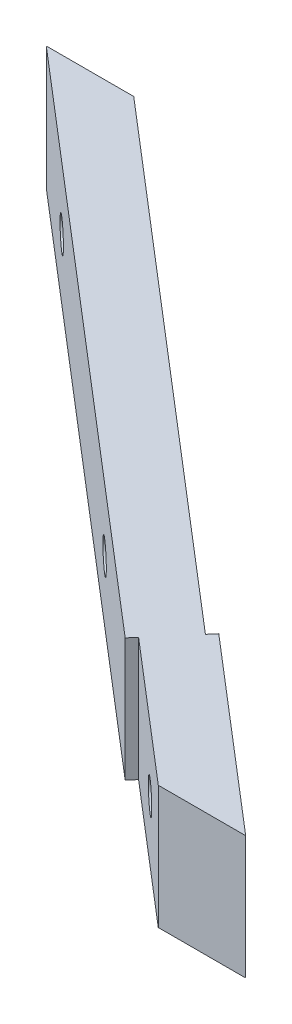
ISO-10303-21;
HEADER;
FILE_DESCRIPTION(('STEP AP214'),'2;1');
FILE_NAME('part.step','',(''),(''),'','','');
FILE_SCHEMA(('AUTOMOTIVE_DESIGN { 1 0 10303 214 1 1 1 1 }'));
ENDSEC;
DATA;
#1=APPLICATION_CONTEXT('core data for automotive mechanical design processes');
#2=APPLICATION_PROTOCOL_DEFINITION('international standard','automotive_design',2000,#1);
#3=PRODUCT_CONTEXT('',#1,'mechanical');
#4=PRODUCT('Part','Part','',(#3));
#5=PRODUCT_RELATED_PRODUCT_CATEGORY('part','',(#4));
#6=PRODUCT_DEFINITION_FORMATION('','',#4);
#7=PRODUCT_DEFINITION_CONTEXT('part definition',#1,'design');
#8=PRODUCT_DEFINITION('design','',#6,#7);
#9=PRODUCT_DEFINITION_SHAPE('','',#8);
#10=(LENGTH_UNIT() NAMED_UNIT(*) SI_UNIT(.MILLI.,.METRE.));
#11=(NAMED_UNIT(*) PLANE_ANGLE_UNIT() SI_UNIT($,.RADIAN.));
#12=(NAMED_UNIT(*) SI_UNIT($,.STERADIAN.) SOLID_ANGLE_UNIT());
#13=UNCERTAINTY_MEASURE_WITH_UNIT(LENGTH_MEASURE(1.E-05),#10,'distance_accuracy_value','');
#14=(GEOMETRIC_REPRESENTATION_CONTEXT(3) GLOBAL_UNCERTAINTY_ASSIGNED_CONTEXT((#13)) GLOBAL_UNIT_ASSIGNED_CONTEXT((#10,
#11,#12)) REPRESENTATION_CONTEXT('',''));
#15=CARTESIAN_POINT('',(0.,0.,0.));
#16=DIRECTION('',(0.,0.,1.));
#17=DIRECTION('',(1.,0.,0.));
#18=AXIS2_PLACEMENT_3D('',#15,#16,#17);
#19=CARTESIAN_POINT('',(62.1354603296371,0.249999999999999,-17.0285302397047));
#20=DIRECTION('',(0.650774217265846,0.,-0.759271307334885));
#21=DIRECTION('',(-0.759271307334885,0.,-0.650774217265846));
#22=AXIS2_PLACEMENT_3D('',#19,#20,#21);
#23=PLANE('',#22);
#24=CARTESIAN_POINT('',(70.613674794916,-6.375,-9.76182158213607));
#25=DIRECTION('',(0.650774217265846,0.,-0.759271307334885));
#26=DIRECTION('',(-0.759271307334885,0.,-0.650774217265846));
#27=AXIS2_PLACEMENT_3D('',#24,#25,#26);
#28=CIRCLE('',#27,1.62500000000002);
#29=CARTESIAN_POINT('',(69.3798589204968,-6.375,-10.8193296851931));
#30=VERTEX_POINT('',#29);
#31=EDGE_CURVE('E191',#30,#30,#28,.F.);
#32=ORIENTED_EDGE('',*,*,#31,.T.);
#33=EDGE_LOOP('',(#32));
#34=FACE_BOUND('',#33,.T.);
#35=DIRECTION('',(0.759271307334885,0.,0.650774217265846));
#36=VECTOR('',#35,1.);
#37=CARTESIAN_POINT('',(62.1354603296371,-12.75,-17.0285302397047));
#38=LINE('',#37,#36);
#39=CARTESIAN_POINT('',(62.1354603296371,-12.75,-17.0285302397047));
#40=VERTEX_POINT('',#39);
#41=CARTESIAN_POINT('',(82.002987459727,-12.75,0.));
#42=VERTEX_POINT('',#41);
#43=EDGE_CURVE('E170',#40,#42,#38,.T.);
#44=ORIENTED_EDGE('',*,*,#43,.F.);
#45=DIRECTION('',(0.,-1.,0.));
#46=VECTOR('',#45,1.);
#47=CARTESIAN_POINT('',(62.1354603296371,0.249999999999999,-17.0285302397047));
#48=LINE('',#47,#46);
#49=CARTESIAN_POINT('',(62.1354603296371,0.249999999999999,-17.0285302397047));
#50=VERTEX_POINT('',#49);
#51=EDGE_CURVE('E11',#50,#40,#48,.T.);
#52=ORIENTED_EDGE('',*,*,#51,.F.);
#53=DIRECTION('',(0.759271307334885,0.,0.650774217265846));
#54=VECTOR('',#53,1.);
#55=CARTESIAN_POINT('',(82.002987459727,0.249999999999999,0.));
#56=LINE('',#55,#54);
#57=CARTESIAN_POINT('',(82.002987459727,0.249999999999999,0.));
#58=VERTEX_POINT('',#57);
#59=EDGE_CURVE('E59',#50,#58,#56,.T.);
#60=ORIENTED_EDGE('',*,*,#59,.T.);
#61=DIRECTION('',(0.,-1.,0.));
#62=VECTOR('',#61,1.);
#63=CARTESIAN_POINT('',(82.002987459727,0.249999999999999,0.));
#64=LINE('',#63,#62);
#65=EDGE_CURVE('E100',#58,#42,#64,.T.);
#66=ORIENTED_EDGE('',*,*,#65,.T.);
#67=EDGE_LOOP('',(#44,#52,#60,#66));
#68=FACE_BOUND('',#67,.T.);
#69=ADVANCED_FACE('F39',(#34,#68),#23,.T.);
#70=CARTESIAN_POINT('',(61.4846861123713,0.249999999999999,-16.2692589323698));
#71=DIRECTION('',(-0.759271307334888,0.,-0.650774217265843));
#72=DIRECTION('',(-0.650774217265843,0.,0.759271307334888));
#73=AXIS2_PLACEMENT_3D('',#70,#71,#72);
#74=PLANE('',#73);
#75=DIRECTION('',(0.650774217265843,0.,-0.759271307334888));
#76=VECTOR('',#75,1.);
#77=CARTESIAN_POINT('',(61.4846861123713,-12.75,-16.2692589323698));
#78=LINE('',#77,#76);
#79=CARTESIAN_POINT('',(61.4846861123713,-12.75,-16.2692589323698));
#80=VERTEX_POINT('',#79);
#81=EDGE_CURVE('E167',#80,#40,#78,.T.);
#82=ORIENTED_EDGE('',*,*,#81,.F.);
#83=DIRECTION('',(0.,-1.,0.));
#84=VECTOR('',#83,1.);
#85=CARTESIAN_POINT('',(61.4846861123713,0.249999999999999,-16.2692589323698));
#86=LINE('',#85,#84);
#87=CARTESIAN_POINT('',(61.4846861123713,0.249999999999999,-16.2692589323698));
#88=VERTEX_POINT('',#87);
#89=EDGE_CURVE('E50',#88,#80,#86,.T.);
#90=ORIENTED_EDGE('',*,*,#89,.F.);
#91=DIRECTION('',(0.650774217265843,0.,-0.759271307334888));
#92=VECTOR('',#91,1.);
#93=CARTESIAN_POINT('',(61.4846861123713,0.249999999999999,-16.2692589323698));
#94=LINE('',#93,#92);
#95=EDGE_CURVE('E131',#88,#50,#94,.T.);
#96=ORIENTED_EDGE('',*,*,#95,.T.);
#97=ORIENTED_EDGE('',*,*,#51,.T.);
#98=EDGE_LOOP('',(#82,#90,#96,#97));
#99=FACE_BOUND('',#98,.T.);
#100=ADVANCED_FACE('F231',(#99),#74,.T.);
#101=CARTESIAN_POINT('',(8.56917557383048,0.249999999999999,-61.6233367426));
#102=DIRECTION('',(0.650774217265846,0.,-0.759271307334884));
#103=DIRECTION('',(-0.759271307334885,0.,-0.650774217265847));
#104=AXIS2_PLACEMENT_3D('',#101,#102,#103);
#105=PLANE('',#104);
#106=CARTESIAN_POINT('',(46.2992599656736,-6.375,-29.2847432776867));
#107=DIRECTION('',(0.650774217265846,0.,-0.759271307334884));
#108=DIRECTION('',(-0.759271307334885,0.,-0.650774217265847));
#109=AXIS2_PLACEMENT_3D('',#106,#107,#108);
#110=CIRCLE('',#109,1.62500000000001);
#111=CARTESIAN_POINT('',(45.0654440912544,-6.375,-30.3422513807437));
#112=VERTEX_POINT('',#111);
#113=EDGE_CURVE('E150',#112,#112,#110,.F.);
#114=ORIENTED_EDGE('',*,*,#113,.T.);
#115=EDGE_LOOP('',(#114));
#116=FACE_BOUND('',#115,.T.);
#117=CARTESIAN_POINT('',(14.6431029777218,-6.375,-56.4173513276216));
#118=DIRECTION('',(0.650774217265846,0.,-0.759271307334884));
#119=DIRECTION('',(-0.759271307334885,0.,-0.650774217265847));
#120=AXIS2_PLACEMENT_3D('',#117,#118,#119);
#121=CIRCLE('',#120,1.625);
#122=CARTESIAN_POINT('',(13.4092871033027,-6.375,-57.4748594306786));
#123=VERTEX_POINT('',#122);
#124=EDGE_CURVE('E195',#123,#123,#121,.F.);
#125=ORIENTED_EDGE('',*,*,#124,.T.);
#126=EDGE_LOOP('',(#125));
#127=FACE_BOUND('',#126,.T.);
#128=DIRECTION('',(0.759271307334885,0.,0.650774217265847));
#129=VECTOR('',#128,1.);
#130=CARTESIAN_POINT('',(8.56917557383048,-12.75,-61.6233367426));
#131=LINE('',#130,#129);
#132=CARTESIAN_POINT('',(8.56917557383048,-12.75,-61.6233367426));
#133=VERTEX_POINT('',#132);
#134=EDGE_CURVE('E118',#133,#80,#131,.T.);
#135=ORIENTED_EDGE('',*,*,#134,.F.);
#136=DIRECTION('',(0.,-1.,0.));
#137=VECTOR('',#136,1.);
#138=CARTESIAN_POINT('',(8.56917557383048,0.249999999999999,-61.6233367426));
#139=LINE('',#138,#137);
#140=CARTESIAN_POINT('',(8.56917557383048,0.249999999999999,-61.6233367426));
#141=VERTEX_POINT('',#140);
#142=EDGE_CURVE('E113',#141,#133,#139,.T.);
#143=ORIENTED_EDGE('',*,*,#142,.F.);
#144=DIRECTION('',(0.759271307334885,0.,0.650774217265847));
#145=VECTOR('',#144,1.);
#146=CARTESIAN_POINT('',(8.56917557383048,0.249999999999999,-61.6233367426));
#147=LINE('',#146,#145);
#148=EDGE_CURVE('E116',#141,#88,#147,.T.);
#149=ORIENTED_EDGE('',*,*,#148,.T.);
#150=ORIENTED_EDGE('',*,*,#89,.T.);
#151=EDGE_LOOP('',(#135,#143,#149,#150));
#152=FACE_BOUND('',#151,.T.);
#153=ADVANCED_FACE('F115',(#116,#127,#152),#105,.T.);
#154=CARTESIAN_POINT('',(-0.650611935896497,0.249999999999999,-61.6233367426));
#155=DIRECTION('',(0.,0.,-1.));
#156=DIRECTION('',(-1.,0.,0.));
#157=AXIS2_PLACEMENT_3D('',#154,#155,#156);
#158=PLANE('',#157);
#159=DIRECTION('',(1.,0.,0.));
#160=VECTOR('',#159,1.);
#161=CARTESIAN_POINT('',(-0.650611935896497,-12.75,-61.6233367426));
#162=LINE('',#161,#160);
#163=CARTESIAN_POINT('',(-0.650611935896497,-12.75,-61.6233367426));
#164=VERTEX_POINT('',#163);
#165=EDGE_CURVE('E162',#164,#133,#162,.T.);
#166=ORIENTED_EDGE('',*,*,#165,.F.);
#167=DIRECTION('',(0.,-1.,0.));
#168=VECTOR('',#167,1.);
#169=CARTESIAN_POINT('',(-0.650611935896497,0.249999999999999,-61.6233367426));
#170=LINE('',#169,#168);
#171=CARTESIAN_POINT('',(-0.650611935896497,0.249999999999999,-61.6233367426));
#172=VERTEX_POINT('',#171);
#173=EDGE_CURVE('E124',#172,#164,#170,.T.);
#174=ORIENTED_EDGE('',*,*,#173,.F.);
#175=DIRECTION('',(1.,0.,0.));
#176=VECTOR('',#175,1.);
#177=CARTESIAN_POINT('',(-0.650611935896497,0.249999999999999,-61.6233367426));
#178=LINE('',#177,#176);
#179=EDGE_CURVE('E129',#172,#141,#178,.T.);
#180=ORIENTED_EDGE('',*,*,#179,.T.);
#181=ORIENTED_EDGE('',*,*,#142,.T.);
#182=EDGE_LOOP('',(#166,#174,#180,#181));
#183=FACE_BOUND('',#182,.T.);
#184=ADVANCED_FACE('F134',(#183),#158,.T.);
#185=CARTESIAN_POINT('',(-0.650611935896497,0.249999999999999,-61.6233367426));
#186=DIRECTION('',(-0.650774217265847,0.,0.759271307334884));
#187=DIRECTION('',(0.759271307334884,0.,0.650774217265847));
#188=AXIS2_PLACEMENT_3D('',#185,#186,#187);
#189=PLANE('',#188);
#190=CARTESIAN_POINT('',(42.3946146620785,-6.375,-24.7291154336774));
#191=DIRECTION('',(-0.650774217265847,0.,0.759271307334884));
#192=DIRECTION('',(0.759271307334884,0.,0.650774217265847));
#193=AXIS2_PLACEMENT_3D('',#190,#191,#192);
#194=CIRCLE('',#193,1.62500000000001);
#195=CARTESIAN_POINT('',(43.6284305364977,-6.375,-23.6716073306204));
#196=VERTEX_POINT('',#195);
#197=EDGE_CURVE('E43',#196,#196,#194,.F.);
#198=ORIENTED_EDGE('',*,*,#197,.T.);
#199=EDGE_LOOP('',(#198));
#200=FACE_BOUND('',#199,.T.);
#201=CARTESIAN_POINT('',(10.7384576741268,-6.375,-51.8617234836123));
#202=DIRECTION('',(-0.650774217265847,0.,0.759271307334884));
#203=DIRECTION('',(0.759271307334884,0.,0.650774217265847));
#204=AXIS2_PLACEMENT_3D('',#201,#202,#203);
#205=CIRCLE('',#204,1.625);
#206=CARTESIAN_POINT('',(11.9722735485459,-6.375,-50.8042153805553));
#207=VERTEX_POINT('',#206);
#208=EDGE_CURVE('E192',#207,#207,#205,.F.);
#209=ORIENTED_EDGE('',*,*,#208,.T.);
#210=EDGE_LOOP('',(#209));
#211=FACE_BOUND('',#210,.T.);
#212=DIRECTION('',(-0.759271307334884,0.,-0.650774217265847));
#213=VECTOR('',#212,1.);
#214=CARTESIAN_POINT('',(-0.650611935896497,-12.75,-61.6233367426));
#215=LINE('',#214,#213);
#216=CARTESIAN_POINT('',(57.5800408087762,-12.75,-11.7136310883605));
#217=VERTEX_POINT('',#216);
#218=EDGE_CURVE('E158',#217,#164,#215,.T.);
#219=ORIENTED_EDGE('',*,*,#218,.F.);
#220=DIRECTION('',(0.,-1.,0.));
#221=VECTOR('',#220,1.);
#222=CARTESIAN_POINT('',(57.5800408087762,0.249999999999999,-11.7136310883605));
#223=LINE('',#222,#221);
#224=CARTESIAN_POINT('',(57.5800408087762,0.249999999999999,-11.7136310883605));
#225=VERTEX_POINT('',#224);
#226=EDGE_CURVE('E177',#225,#217,#223,.T.);
#227=ORIENTED_EDGE('',*,*,#226,.F.);
#228=DIRECTION('',(-0.759271307334884,0.,-0.650774217265847));
#229=VECTOR('',#228,1.);
#230=CARTESIAN_POINT('',(-0.650611935896497,0.249999999999999,-61.6233367426));
#231=LINE('',#230,#229);
#232=EDGE_CURVE('E136',#225,#172,#231,.T.);
#233=ORIENTED_EDGE('',*,*,#232,.T.);
#234=ORIENTED_EDGE('',*,*,#173,.T.);
#235=EDGE_LOOP('',(#219,#227,#233,#234));
#236=FACE_BOUND('',#235,.T.);
#237=ADVANCED_FACE('F235',(#200,#211,#236),#189,.T.);
#238=CARTESIAN_POINT('',(57.5800408087762,0.249999999999999,-11.7136310883605));
#239=DIRECTION('',(0.759271307334886,0.,0.650774217265845));
#240=DIRECTION('',(0.650774217265845,0.,-0.759271307334886));
#241=AXIS2_PLACEMENT_3D('',#238,#239,#240);
#242=PLANE('',#241);
#243=DIRECTION('',(-0.650774217265845,0.,0.759271307334885));
#244=VECTOR('',#243,1.);
#245=CARTESIAN_POINT('',(57.5800408087762,-12.75,-11.7136310883605));
#246=LINE('',#245,#244);
#247=CARTESIAN_POINT('',(58.2308150260421,-12.75,-12.4729023956954));
#248=VERTEX_POINT('',#247);
#249=EDGE_CURVE('E154',#248,#217,#246,.T.);
#250=ORIENTED_EDGE('',*,*,#249,.F.);
#251=DIRECTION('',(0.,-1.,0.));
#252=VECTOR('',#251,1.);
#253=CARTESIAN_POINT('',(58.2308150260421,0.249999999999999,-12.4729023956954));
#254=LINE('',#253,#252);
#255=CARTESIAN_POINT('',(58.2308150260421,0.249999999999999,-12.4729023956954));
#256=VERTEX_POINT('',#255);
#257=EDGE_CURVE('E180',#256,#248,#254,.T.);
#258=ORIENTED_EDGE('',*,*,#257,.F.);
#259=DIRECTION('',(-0.650774217265845,0.,0.759271307334885));
#260=VECTOR('',#259,1.);
#261=CARTESIAN_POINT('',(57.5800408087762,0.249999999999999,-11.7136310883605));
#262=LINE('',#261,#260);
#263=EDGE_CURVE('E139',#256,#225,#262,.T.);
#264=ORIENTED_EDGE('',*,*,#263,.T.);
#265=ORIENTED_EDGE('',*,*,#226,.T.);
#266=EDGE_LOOP('',(#250,#258,#264,#265));
#267=FACE_BOUND('',#266,.T.);
#268=ADVANCED_FACE('F223',(#267),#242,.T.);
#269=CARTESIAN_POINT('',(58.2308150260421,0.249999999999999,-12.4729023956954));
#270=DIRECTION('',(-0.650774217265846,0.,0.759271307334884));
#271=DIRECTION('',(0.759271307334885,0.,0.650774217265847));
#272=AXIS2_PLACEMENT_3D('',#269,#270,#271);
#273=PLANE('',#272);
#274=CARTESIAN_POINT('',(66.7090294913209,-6.375,-5.20619373812676));
#275=DIRECTION('',(-0.650774217265846,0.,0.759271307334884));
#276=DIRECTION('',(0.759271307334885,0.,0.650774217265847));
#277=AXIS2_PLACEMENT_3D('',#274,#275,#276);
#278=CIRCLE('',#277,1.62500000000002);
#279=CARTESIAN_POINT('',(67.9428453657401,-6.375,-4.14868563506975));
#280=VERTEX_POINT('',#279);
#281=EDGE_CURVE('E188',#280,#280,#278,.F.);
#282=ORIENTED_EDGE('',*,*,#281,.T.);
#283=EDGE_LOOP('',(#282));
#284=FACE_BOUND('',#283,.T.);
#285=DIRECTION('',(-0.759271307334885,0.,-0.650774217265847));
#286=VECTOR('',#285,1.);
#287=CARTESIAN_POINT('',(58.2308150260421,-12.75,-12.4729023956954));
#288=LINE('',#287,#286);
#289=CARTESIAN_POINT('',(72.78319995,-12.75,0.));
#290=VERTEX_POINT('',#289);
#291=EDGE_CURVE('E149',#290,#248,#288,.T.);
#292=ORIENTED_EDGE('',*,*,#291,.F.);
#293=DIRECTION('',(0.,-1.,0.));
#294=VECTOR('',#293,1.);
#295=CARTESIAN_POINT('',(72.78319995,0.249999999999999,0.));
#296=LINE('',#295,#294);
#297=CARTESIAN_POINT('',(72.78319995,0.249999999999999,0.));
#298=VERTEX_POINT('',#297);
#299=EDGE_CURVE('E183',#298,#290,#296,.T.);
#300=ORIENTED_EDGE('',*,*,#299,.F.);
#301=DIRECTION('',(-0.759271307334885,0.,-0.650774217265847));
#302=VECTOR('',#301,1.);
#303=CARTESIAN_POINT('',(58.2308150260421,0.249999999999999,-12.4729023956954));
#304=LINE('',#303,#302);
#305=EDGE_CURVE('E215',#298,#256,#304,.T.);
#306=ORIENTED_EDGE('',*,*,#305,.T.);
#307=ORIENTED_EDGE('',*,*,#257,.T.);
#308=EDGE_LOOP('',(#292,#300,#306,#307));
#309=FACE_BOUND('',#308,.T.);
#310=ADVANCED_FACE('F228',(#284,#309),#273,.T.);
#311=CARTESIAN_POINT('',(82.002987459727,0.249999999999999,0.));
#312=DIRECTION('',(0.,0.,1.));
#313=DIRECTION('',(1.,0.,0.));
#314=AXIS2_PLACEMENT_3D('',#311,#312,#313);
#315=PLANE('',#314);
#316=DIRECTION('',(-1.,0.,0.));
#317=VECTOR('',#316,1.);
#318=CARTESIAN_POINT('',(82.002987459727,-12.75,0.));
#319=LINE('',#318,#317);
#320=EDGE_CURVE('E145',#42,#290,#319,.T.);
#321=ORIENTED_EDGE('',*,*,#320,.F.);
#322=ORIENTED_EDGE('',*,*,#65,.F.);
#323=DIRECTION('',(-1.,0.,0.));
#324=VECTOR('',#323,1.);
#325=CARTESIAN_POINT('',(82.002987459727,0.249999999999999,0.));
#326=LINE('',#325,#324);
#327=EDGE_CURVE('E212',#58,#298,#326,.T.);
#328=ORIENTED_EDGE('',*,*,#327,.T.);
#329=ORIENTED_EDGE('',*,*,#299,.T.);
#330=EDGE_LOOP('',(#321,#322,#328,#329));
#331=FACE_BOUND('',#330,.T.);
#332=ADVANCED_FACE('F41',(#331),#315,.T.);
#333=CARTESIAN_POINT('',(0.,0.249999999999999,0.));
#334=DIRECTION('',(0.,-1.,0.));
#335=DIRECTION('',(0.,0.,-1.));
#336=AXIS2_PLACEMENT_3D('',#333,#334,#335);
#337=PLANE('',#336);
#338=ORIENTED_EDGE('',*,*,#59,.F.);
#339=ORIENTED_EDGE('',*,*,#95,.F.);
#340=ORIENTED_EDGE('',*,*,#148,.F.);
#341=ORIENTED_EDGE('',*,*,#179,.F.);
#342=ORIENTED_EDGE('',*,*,#232,.F.);
#343=ORIENTED_EDGE('',*,*,#263,.F.);
#344=ORIENTED_EDGE('',*,*,#305,.F.);
#345=ORIENTED_EDGE('',*,*,#327,.F.);
#346=EDGE_LOOP('',(#338,#339,#340,#341,#342,#343,#344,#345));
#347=FACE_BOUND('',#346,.T.);
#348=ADVANCED_FACE('F127',(#347),#337,.F.);
#349=CARTESIAN_POINT('',(0.,-12.75,0.));
#350=DIRECTION('',(0.,-1.,0.));
#351=DIRECTION('',(0.,0.,-1.));
#352=AXIS2_PLACEMENT_3D('',#349,#350,#351);
#353=PLANE('',#352);
#354=ORIENTED_EDGE('',*,*,#43,.T.);
#355=ORIENTED_EDGE('',*,*,#320,.T.);
#356=ORIENTED_EDGE('',*,*,#291,.T.);
#357=ORIENTED_EDGE('',*,*,#249,.T.);
#358=ORIENTED_EDGE('',*,*,#218,.T.);
#359=ORIENTED_EDGE('',*,*,#165,.T.);
#360=ORIENTED_EDGE('',*,*,#134,.T.);
#361=ORIENTED_EDGE('',*,*,#81,.T.);
#362=EDGE_LOOP('',(#354,#355,#356,#357,#358,#359,#360,#361));
#363=FACE_BOUND('',#362,.T.);
#364=ADVANCED_FACE('F233',(#363),#353,.T.);
#365=CARTESIAN_POINT('',(76.4706427503087,-6.375,-16.5952633481501));
#366=DIRECTION('',(-0.650774217265847,0.,0.759271307334884));
#367=DIRECTION('',(0.759271307334884,0.,0.650774217265847));
#368=AXIS2_PLACEMENT_3D('',#365,#366,#367);
#369=CYLINDRICAL_SURFACE('',#368,1.62500000000002);
#370=ORIENTED_EDGE('',*,*,#31,.F.);
#371=EDGE_LOOP('',(#370));
#372=FACE_BOUND('',#371,.T.);
#373=ORIENTED_EDGE('',*,*,#281,.F.);
#374=EDGE_LOOP('',(#373));
#375=FACE_BOUND('',#374,.T.);
#376=ADVANCED_FACE('F267',(#372,#375),#369,.F.);
#377=CARTESIAN_POINT('',(21.1508451503803,-6.375,-64.0100644009705));
#378=DIRECTION('',(-0.650774217265847,0.,0.759271307334884));
#379=DIRECTION('',(0.759271307334884,0.,0.650774217265847));
#380=AXIS2_PLACEMENT_3D('',#377,#378,#379);
#381=CYLINDRICAL_SURFACE('',#380,1.625);
#382=ORIENTED_EDGE('',*,*,#124,.F.);
#383=EDGE_LOOP('',(#382));
#384=FACE_BOUND('',#383,.T.);
#385=ORIENTED_EDGE('',*,*,#208,.F.);
#386=EDGE_LOOP('',(#385));
#387=FACE_BOUND('',#386,.T.);
#388=ADVANCED_FACE('F263',(#384,#387),#381,.F.);
#389=CARTESIAN_POINT('',(52.8070021383321,-6.375,-36.8774563510356));
#390=DIRECTION('',(-0.650774217265847,0.,0.759271307334884));
#391=DIRECTION('',(0.759271307334884,0.,0.650774217265847));
#392=AXIS2_PLACEMENT_3D('',#389,#390,#391);
#393=CYLINDRICAL_SURFACE('',#392,1.62500000000001);
#394=ORIENTED_EDGE('',*,*,#113,.F.);
#395=EDGE_LOOP('',(#394));
#396=FACE_BOUND('',#395,.T.);
#397=ORIENTED_EDGE('',*,*,#197,.F.);
#398=EDGE_LOOP('',(#397));
#399=FACE_BOUND('',#398,.T.);
#400=ADVANCED_FACE('F266',(#396,#399),#393,.F.);
#401=CLOSED_SHELL('',(#69,#100,#153,#184,#237,#268,#310,#332,#348,#364,#376,#388,#400));
#402=MANIFOLD_SOLID_BREP('B2',#401);
#403=ADVANCED_BREP_SHAPE_REPRESENTATION('',(#18,#402),#14);
#404=SHAPE_DEFINITION_REPRESENTATION(#9,#403);
ENDSEC;
END-ISO-10303-21;
